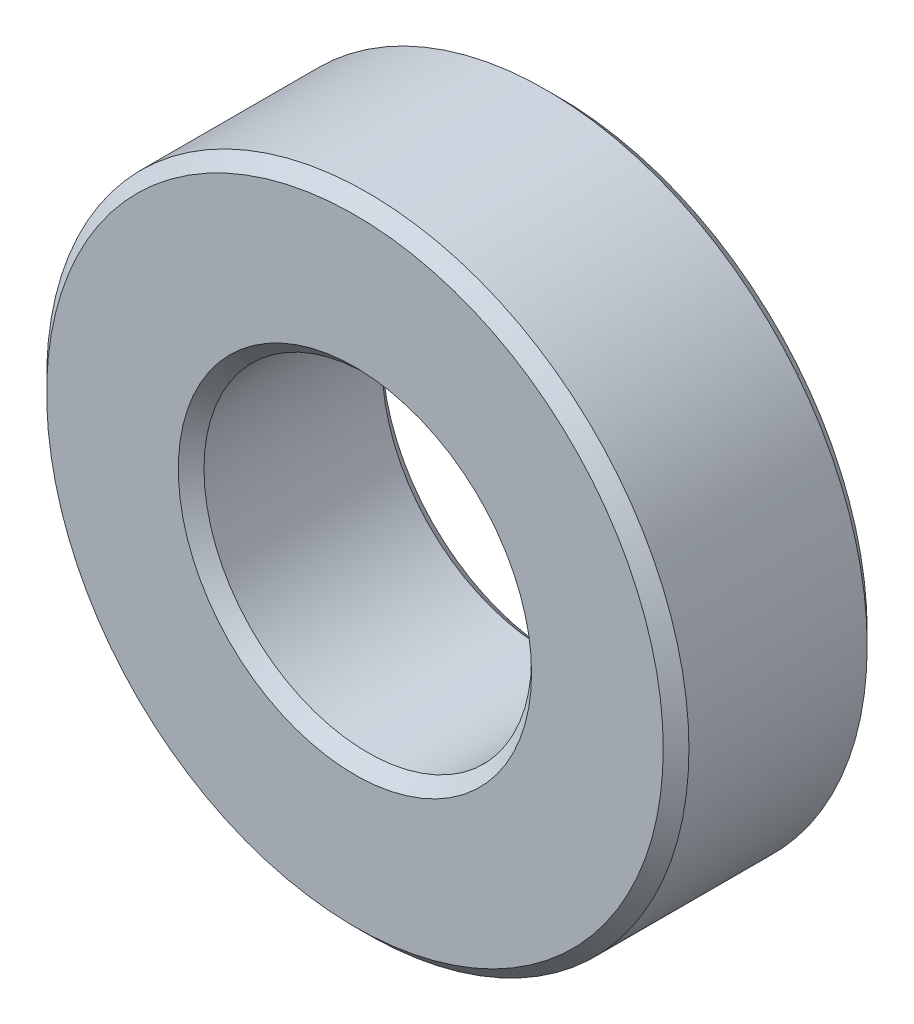
ISO-10303-21;
HEADER;
FILE_DESCRIPTION(('STEP AP214'),'2;1');
FILE_NAME('part.step','',(''),(''),'','','');
FILE_SCHEMA(('AUTOMOTIVE_DESIGN { 1 0 10303 214 1 1 1 1 }'));
ENDSEC;
DATA;
#1=APPLICATION_CONTEXT('core data for automotive mechanical design processes');
#2=APPLICATION_PROTOCOL_DEFINITION('international standard','automotive_design',2000,#1);
#3=PRODUCT_CONTEXT('',#1,'mechanical');
#4=PRODUCT('Part','Part','',(#3));
#5=PRODUCT_RELATED_PRODUCT_CATEGORY('part','',(#4));
#6=PRODUCT_DEFINITION_FORMATION('','',#4);
#7=PRODUCT_DEFINITION_CONTEXT('part definition',#1,'design');
#8=PRODUCT_DEFINITION('design','',#6,#7);
#9=PRODUCT_DEFINITION_SHAPE('','',#8);
#10=(LENGTH_UNIT() NAMED_UNIT(*) SI_UNIT(.MILLI.,.METRE.));
#11=(NAMED_UNIT(*) PLANE_ANGLE_UNIT() SI_UNIT($,.RADIAN.));
#12=(NAMED_UNIT(*) SI_UNIT($,.STERADIAN.) SOLID_ANGLE_UNIT());
#13=UNCERTAINTY_MEASURE_WITH_UNIT(LENGTH_MEASURE(1.E-05),#10,'distance_accuracy_value','');
#14=(GEOMETRIC_REPRESENTATION_CONTEXT(3) GLOBAL_UNCERTAINTY_ASSIGNED_CONTEXT((#13)) GLOBAL_UNIT_ASSIGNED_CONTEXT((#10,
#11,#12)) REPRESENTATION_CONTEXT('',''));
#15=CARTESIAN_POINT('',(0.,0.,0.));
#16=DIRECTION('',(0.,0.,1.));
#17=DIRECTION('',(1.,0.,0.));
#18=AXIS2_PLACEMENT_3D('',#15,#16,#17);
#19=CARTESIAN_POINT('',(0.,0.,3.175));
#20=DIRECTION('',(0.,0.,1.));
#21=DIRECTION('',(1.,0.,0.));
#22=AXIS2_PLACEMENT_3D('',#19,#20,#21);
#23=PLANE('',#22);
#24=CARTESIAN_POINT('',(0.,0.,3.175));
#25=DIRECTION('',(0.,0.,1.));
#26=DIRECTION('',(1.,0.,0.));
#27=AXIS2_PLACEMENT_3D('',#24,#25,#26);
#28=CIRCLE('',#27,2.75);
#29=CARTESIAN_POINT('',(2.75,0.,3.175));
#30=VERTEX_POINT('',#29);
#31=EDGE_CURVE('E10',#30,#30,#28,.F.);
#32=ORIENTED_EDGE('',*,*,#31,.T.);
#33=EDGE_LOOP('',(#32));
#34=FACE_BOUND('',#33,.T.);
#35=CARTESIAN_POINT('',(0.,0.,3.175));
#36=DIRECTION('',(0.,0.,1.));
#37=DIRECTION('',(1.,0.,0.));
#38=AXIS2_PLACEMENT_3D('',#35,#36,#37);
#39=CIRCLE('',#38,4.8);
#40=CARTESIAN_POINT('',(4.8,0.,3.175));
#41=VERTEX_POINT('',#40);
#42=EDGE_CURVE('E39',#41,#41,#39,.T.);
#43=ORIENTED_EDGE('',*,*,#42,.T.);
#44=EDGE_LOOP('',(#43));
#45=FACE_BOUND('',#44,.T.);
#46=ADVANCED_FACE('F32',(#34,#45),#23,.T.);
#47=CARTESIAN_POINT('',(0.,0.,0.));
#48=DIRECTION('',(0.,0.,1.));
#49=DIRECTION('',(1.,0.,0.));
#50=AXIS2_PLACEMENT_3D('',#47,#48,#49);
#51=PLANE('',#50);
#52=CARTESIAN_POINT('',(0.,0.,0.));
#53=DIRECTION('',(0.,0.,1.));
#54=DIRECTION('',(1.,0.,0.));
#55=AXIS2_PLACEMENT_3D('',#52,#53,#54);
#56=CIRCLE('',#55,4.8);
#57=CARTESIAN_POINT('',(4.8,0.,0.));
#58=VERTEX_POINT('',#57);
#59=EDGE_CURVE('E52',#58,#58,#56,.F.);
#60=ORIENTED_EDGE('',*,*,#59,.T.);
#61=EDGE_LOOP('',(#60));
#62=FACE_BOUND('',#61,.T.);
#63=CARTESIAN_POINT('',(0.,0.,0.));
#64=DIRECTION('',(0.,0.,1.));
#65=DIRECTION('',(1.,0.,0.));
#66=AXIS2_PLACEMENT_3D('',#63,#64,#65);
#67=CIRCLE('',#66,2.75);
#68=CARTESIAN_POINT('',(2.75,0.,0.));
#69=VERTEX_POINT('',#68);
#70=EDGE_CURVE('E55',#69,#69,#67,.T.);
#71=ORIENTED_EDGE('',*,*,#70,.T.);
#72=EDGE_LOOP('',(#71));
#73=FACE_BOUND('',#72,.T.);
#74=ADVANCED_FACE('F76',(#62,#73),#51,.F.);
#75=CARTESIAN_POINT('',(0.,0.,3.175));
#76=DIRECTION('',(0.,0.,-1.));
#77=DIRECTION('',(-1.,0.,0.));
#78=AXIS2_PLACEMENT_3D('',#75,#76,#77);
#79=CYLINDRICAL_SURFACE('',#78,5.);
#80=CARTESIAN_POINT('',(0.,0.,0.2));
#81=DIRECTION('',(0.,0.,1.));
#82=DIRECTION('',(1.,0.,0.));
#83=AXIS2_PLACEMENT_3D('',#80,#81,#82);
#84=CIRCLE('',#83,5.);
#85=CARTESIAN_POINT('',(5.,0.,0.2));
#86=VERTEX_POINT('',#85);
#87=EDGE_CURVE('E58',#86,#86,#84,.T.);
#88=ORIENTED_EDGE('',*,*,#87,.T.);
#89=EDGE_LOOP('',(#88));
#90=FACE_BOUND('',#89,.T.);
#91=CARTESIAN_POINT('',(0.,0.,2.975));
#92=DIRECTION('',(0.,0.,1.));
#93=DIRECTION('',(1.,0.,0.));
#94=AXIS2_PLACEMENT_3D('',#91,#92,#93);
#95=CIRCLE('',#94,5.);
#96=CARTESIAN_POINT('',(5.,0.,2.975));
#97=VERTEX_POINT('',#96);
#98=EDGE_CURVE('E61',#97,#97,#95,.F.);
#99=ORIENTED_EDGE('',*,*,#98,.T.);
#100=EDGE_LOOP('',(#99));
#101=FACE_BOUND('',#100,.T.);
#102=ADVANCED_FACE('F65',(#90,#101),#79,.T.);
#103=CARTESIAN_POINT('',(0.,0.,3.175));
#104=DIRECTION('',(0.,0.,-1.));
#105=DIRECTION('',(-1.,0.,0.));
#106=AXIS2_PLACEMENT_3D('',#103,#104,#105);
#107=CYLINDRICAL_SURFACE('',#106,2.55);
#108=CARTESIAN_POINT('',(0.,0.,0.200000000000001));
#109=DIRECTION('',(0.,0.,1.));
#110=DIRECTION('',(1.,0.,0.));
#111=AXIS2_PLACEMENT_3D('',#108,#109,#110);
#112=CIRCLE('',#111,2.55);
#113=CARTESIAN_POINT('',(2.55,0.,0.200000000000001));
#114=VERTEX_POINT('',#113);
#115=EDGE_CURVE('E43',#114,#114,#112,.F.);
#116=ORIENTED_EDGE('',*,*,#115,.T.);
#117=EDGE_LOOP('',(#116));
#118=FACE_BOUND('',#117,.T.);
#119=CARTESIAN_POINT('',(0.,0.,2.975));
#120=DIRECTION('',(0.,0.,1.));
#121=DIRECTION('',(1.,0.,0.));
#122=AXIS2_PLACEMENT_3D('',#119,#120,#121);
#123=CIRCLE('',#122,2.55);
#124=CARTESIAN_POINT('',(2.55,0.,2.975));
#125=VERTEX_POINT('',#124);
#126=EDGE_CURVE('E47',#125,#125,#123,.T.);
#127=ORIENTED_EDGE('',*,*,#126,.T.);
#128=EDGE_LOOP('',(#127));
#129=FACE_BOUND('',#128,.T.);
#130=ADVANCED_FACE('F84',(#118,#129),#107,.F.);
#131=CARTESIAN_POINT('',(0.,0.,0.2));
#132=DIRECTION('',(0.,0.,1.));
#133=DIRECTION('',(1.,0.,0.));
#134=AXIS2_PLACEMENT_3D('',#131,#132,#133);
#135=CONICAL_SURFACE('',#134,5.,0.785398163397446);
#136=ORIENTED_EDGE('',*,*,#59,.F.);
#137=EDGE_LOOP('',(#136));
#138=FACE_BOUND('',#137,.T.);
#139=ORIENTED_EDGE('',*,*,#87,.F.);
#140=EDGE_LOOP('',(#139));
#141=FACE_BOUND('',#140,.T.);
#142=ADVANCED_FACE('F89',(#138,#141),#135,.T.);
#143=CARTESIAN_POINT('',(0.,0.,0.));
#144=DIRECTION('',(0.,0.,-1.));
#145=DIRECTION('',(-1.,0.,0.));
#146=AXIS2_PLACEMENT_3D('',#143,#144,#145);
#147=CONICAL_SURFACE('',#146,2.75,0.785398163397445);
#148=ORIENTED_EDGE('',*,*,#115,.F.);
#149=EDGE_LOOP('',(#148));
#150=FACE_BOUND('',#149,.T.);
#151=ORIENTED_EDGE('',*,*,#70,.F.);
#152=EDGE_LOOP('',(#151));
#153=FACE_BOUND('',#152,.T.);
#154=ADVANCED_FACE('F73',(#150,#153),#147,.F.);
#155=CARTESIAN_POINT('',(0.,0.,2.975));
#156=DIRECTION('',(0.,0.,1.));
#157=DIRECTION('',(1.,0.,0.));
#158=AXIS2_PLACEMENT_3D('',#155,#156,#157);
#159=CONICAL_SURFACE('',#158,2.55,0.785398163397449);
#160=ORIENTED_EDGE('',*,*,#31,.F.);
#161=EDGE_LOOP('',(#160));
#162=FACE_BOUND('',#161,.T.);
#163=ORIENTED_EDGE('',*,*,#126,.F.);
#164=EDGE_LOOP('',(#163));
#165=FACE_BOUND('',#164,.T.);
#166=ADVANCED_FACE('F69',(#162,#165),#159,.F.);
#167=CARTESIAN_POINT('',(0.,0.,3.175));
#168=DIRECTION('',(0.,0.,-1.));
#169=DIRECTION('',(-1.,0.,0.));
#170=AXIS2_PLACEMENT_3D('',#167,#168,#169);
#171=CONICAL_SURFACE('',#170,4.8,0.785398163397446);
#172=ORIENTED_EDGE('',*,*,#98,.F.);
#173=EDGE_LOOP('',(#172));
#174=FACE_BOUND('',#173,.T.);
#175=ORIENTED_EDGE('',*,*,#42,.F.);
#176=EDGE_LOOP('',(#175));
#177=FACE_BOUND('',#176,.T.);
#178=ADVANCED_FACE('F34',(#174,#177),#171,.T.);
#179=CLOSED_SHELL('',(#46,#74,#102,#130,#142,#154,#166,#178));
#180=MANIFOLD_SOLID_BREP('B2',#179);
#181=ADVANCED_BREP_SHAPE_REPRESENTATION('',(#18,#180),#14);
#182=SHAPE_DEFINITION_REPRESENTATION(#9,#181);
ENDSEC;
END-ISO-10303-21;
